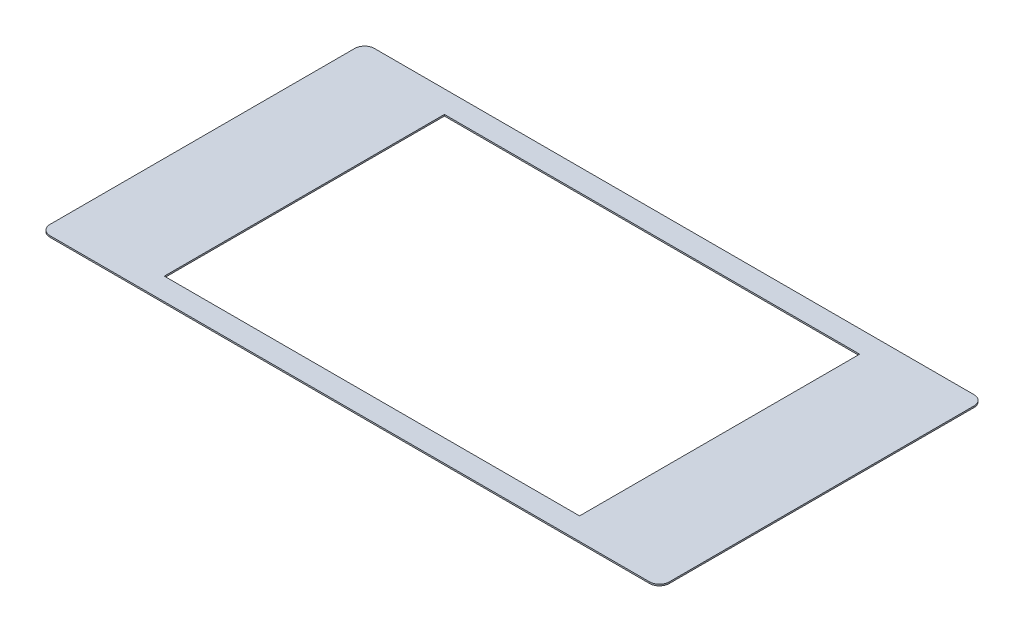
ISO-10303-21;
HEADER;
FILE_DESCRIPTION(('STEP AP214'),'2;1');
FILE_NAME('part.step','',(''),(''),'','','');
FILE_SCHEMA(('AUTOMOTIVE_DESIGN { 1 0 10303 214 1 1 1 1 }'));
ENDSEC;
DATA;
#1=APPLICATION_CONTEXT('core data for automotive mechanical design processes');
#2=APPLICATION_PROTOCOL_DEFINITION('international standard','automotive_design',2000,#1);
#3=PRODUCT_CONTEXT('',#1,'mechanical');
#4=PRODUCT('Part','Part','',(#3));
#5=PRODUCT_RELATED_PRODUCT_CATEGORY('part','',(#4));
#6=PRODUCT_DEFINITION_FORMATION('','',#4);
#7=PRODUCT_DEFINITION_CONTEXT('part definition',#1,'design');
#8=PRODUCT_DEFINITION('design','',#6,#7);
#9=PRODUCT_DEFINITION_SHAPE('','',#8);
#10=(LENGTH_UNIT() NAMED_UNIT(*) SI_UNIT(.MILLI.,.METRE.));
#11=(NAMED_UNIT(*) PLANE_ANGLE_UNIT() SI_UNIT($,.RADIAN.));
#12=(NAMED_UNIT(*) SI_UNIT($,.STERADIAN.) SOLID_ANGLE_UNIT());
#13=UNCERTAINTY_MEASURE_WITH_UNIT(LENGTH_MEASURE(1.E-05),#10,'distance_accuracy_value','');
#14=(GEOMETRIC_REPRESENTATION_CONTEXT(3) GLOBAL_UNCERTAINTY_ASSIGNED_CONTEXT((#13)) GLOBAL_UNIT_ASSIGNED_CONTEXT((#10,
#11,#12)) REPRESENTATION_CONTEXT('',''));
#15=CARTESIAN_POINT('',(0.,0.,0.));
#16=DIRECTION('',(0.,0.,1.));
#17=DIRECTION('',(1.,0.,0.));
#18=AXIS2_PLACEMENT_3D('',#15,#16,#17);
#19=CARTESIAN_POINT('',(2.41486728488105E-13,-34.8,0.));
#20=DIRECTION('',(0.,-1.,0.));
#21=DIRECTION('',(1.,0.,0.));
#22=AXIS2_PLACEMENT_3D('',#19,#20,#21);
#23=PLANE('',#22);
#24=DIRECTION('',(-1.,0.,0.));
#25=VECTOR('',#24,1.);
#26=CARTESIAN_POINT('',(-62.9999999999998,-34.8000000000004,33.));
#27=LINE('',#26,#25);
#28=CARTESIAN_POINT('',(61.0000000000002,-34.7999999999996,33.));
#29=VERTEX_POINT('',#28);
#30=CARTESIAN_POINT('',(-60.9999999999998,-34.8000000000004,33.));
#31=VERTEX_POINT('',#30);
#32=EDGE_CURVE('E169',#29,#31,#27,.T.);
#33=ORIENTED_EDGE('',*,*,#32,.T.);
#34=CARTESIAN_POINT('',(-60.9999999999998,-34.8000000000004,31.));
#35=DIRECTION('',(0.,-1.,0.));
#36=DIRECTION('',(1.,0.,0.));
#37=AXIS2_PLACEMENT_3D('',#34,#35,#36);
#38=CIRCLE('',#37,2.);
#39=CARTESIAN_POINT('',(-62.9999999999998,-34.8000000000004,31.));
#40=VERTEX_POINT('',#39);
#41=EDGE_CURVE('E209',#31,#40,#38,.T.);
#42=ORIENTED_EDGE('',*,*,#41,.T.);
#43=DIRECTION('',(0.,0.,-1.));
#44=VECTOR('',#43,1.);
#45=CARTESIAN_POINT('',(-62.9999999999998,-34.8000000000004,33.));
#46=LINE('',#45,#44);
#47=CARTESIAN_POINT('',(-62.9999999999998,-34.8000000000004,-31.));
#48=VERTEX_POINT('',#47);
#49=EDGE_CURVE('E173',#40,#48,#46,.T.);
#50=ORIENTED_EDGE('',*,*,#49,.T.);
#51=CARTESIAN_POINT('',(-60.9999999999998,-34.8000000000004,-31.));
#52=DIRECTION('',(0.,-1.,0.));
#53=DIRECTION('',(1.,0.,0.));
#54=AXIS2_PLACEMENT_3D('',#51,#52,#53);
#55=CIRCLE('',#54,2.);
#56=CARTESIAN_POINT('',(-60.9999999999998,-34.8000000000004,-33.));
#57=VERTEX_POINT('',#56);
#58=EDGE_CURVE('E55',#48,#57,#55,.T.);
#59=ORIENTED_EDGE('',*,*,#58,.T.);
#60=DIRECTION('',(1.,0.,0.));
#61=VECTOR('',#60,1.);
#62=CARTESIAN_POINT('',(-62.9999999999998,-34.8000000000004,-33.));
#63=LINE('',#62,#61);
#64=CARTESIAN_POINT('',(61.0000000000002,-34.7999999999996,-33.));
#65=VERTEX_POINT('',#64);
#66=EDGE_CURVE('E175',#57,#65,#63,.T.);
#67=ORIENTED_EDGE('',*,*,#66,.T.);
#68=CARTESIAN_POINT('',(61.0000000000002,-34.7999999999996,-31.));
#69=DIRECTION('',(0.,-1.,0.));
#70=DIRECTION('',(1.,0.,0.));
#71=AXIS2_PLACEMENT_3D('',#68,#69,#70);
#72=CIRCLE('',#71,2.);
#73=CARTESIAN_POINT('',(63.0000000000002,-34.7999999999996,-31.));
#74=VERTEX_POINT('',#73);
#75=EDGE_CURVE('E206',#65,#74,#72,.T.);
#76=ORIENTED_EDGE('',*,*,#75,.T.);
#77=DIRECTION('',(0.,0.,1.));
#78=VECTOR('',#77,1.);
#79=CARTESIAN_POINT('',(63.0000000000002,-34.7999999999996,33.));
#80=LINE('',#79,#78);
#81=CARTESIAN_POINT('',(63.0000000000002,-34.7999999999996,31.));
#82=VERTEX_POINT('',#81);
#83=EDGE_CURVE('E166',#74,#82,#80,.T.);
#84=ORIENTED_EDGE('',*,*,#83,.T.);
#85=CARTESIAN_POINT('',(61.0000000000002,-34.7999999999996,31.));
#86=DIRECTION('',(0.,-1.,0.));
#87=DIRECTION('',(1.,0.,0.));
#88=AXIS2_PLACEMENT_3D('',#85,#86,#87);
#89=CIRCLE('',#88,2.);
#90=EDGE_CURVE('E204',#82,#29,#89,.T.);
#91=ORIENTED_EDGE('',*,*,#90,.T.);
#92=EDGE_LOOP('',(#33,#42,#50,#59,#67,#76,#84,#91));
#93=FACE_BOUND('',#92,.T.);
#94=DIRECTION('',(-1.,0.,0.));
#95=VECTOR('',#94,1.);
#96=CARTESIAN_POINT('',(-42.2499999999995,-34.8000000000003,28.5));
#97=LINE('',#96,#95);
#98=CARTESIAN_POINT('',(42.25,-34.7999999999997,28.5));
#99=VERTEX_POINT('',#98);
#100=CARTESIAN_POINT('',(-42.2499999999995,-34.8000000000003,28.5));
#101=VERTEX_POINT('',#100);
#102=EDGE_CURVE('E135',#99,#101,#97,.T.);
#103=ORIENTED_EDGE('',*,*,#102,.F.);
#104=DIRECTION('',(0.,0.,1.));
#105=VECTOR('',#104,1.);
#106=CARTESIAN_POINT('',(42.25,-34.7999999999997,28.5));
#107=LINE('',#106,#105);
#108=CARTESIAN_POINT('',(42.25,-34.7999999999997,-28.5));
#109=VERTEX_POINT('',#108);
#110=EDGE_CURVE('E125',#109,#99,#107,.T.);
#111=ORIENTED_EDGE('',*,*,#110,.F.);
#112=DIRECTION('',(1.,0.,0.));
#113=VECTOR('',#112,1.);
#114=CARTESIAN_POINT('',(-42.2499999999995,-34.8000000000003,-28.5));
#115=LINE('',#114,#113);
#116=CARTESIAN_POINT('',(-42.2499999999995,-34.8000000000003,-28.5));
#117=VERTEX_POINT('',#116);
#118=EDGE_CURVE('E150',#117,#109,#115,.T.);
#119=ORIENTED_EDGE('',*,*,#118,.F.);
#120=DIRECTION('',(0.,0.,-1.));
#121=VECTOR('',#120,1.);
#122=CARTESIAN_POINT('',(-42.2499999999995,-34.8000000000003,28.5));
#123=LINE('',#122,#121);
#124=EDGE_CURVE('E148',#101,#117,#123,.T.);
#125=ORIENTED_EDGE('',*,*,#124,.F.);
#126=EDGE_LOOP('',(#103,#111,#119,#125));
#127=FACE_BOUND('',#126,.T.);
#128=ADVANCED_FACE('F33',(#93,#127),#23,.T.);
#129=CARTESIAN_POINT('',(2.39391839684799E-13,-34.5,0.));
#130=DIRECTION('',(0.,-1.,0.));
#131=DIRECTION('',(1.,0.,0.));
#132=AXIS2_PLACEMENT_3D('',#129,#130,#131);
#133=PLANE('',#132);
#134=DIRECTION('',(0.,0.,-1.));
#135=VECTOR('',#134,1.);
#136=CARTESIAN_POINT('',(-62.9999999999998,-34.5000000000004,33.));
#137=LINE('',#136,#135);
#138=CARTESIAN_POINT('',(-62.9999999999998,-34.5000000000004,31.));
#139=VERTEX_POINT('',#138);
#140=CARTESIAN_POINT('',(-62.9999999999998,-34.5000000000004,-31.));
#141=VERTEX_POINT('',#140);
#142=EDGE_CURVE('E183',#139,#141,#137,.T.);
#143=ORIENTED_EDGE('',*,*,#142,.F.);
#144=CARTESIAN_POINT('',(-60.9999999999998,-34.5000000000004,31.));
#145=DIRECTION('',(0.,-1.,0.));
#146=DIRECTION('',(1.,0.,0.));
#147=AXIS2_PLACEMENT_3D('',#144,#145,#146);
#148=CIRCLE('',#147,2.);
#149=CARTESIAN_POINT('',(-60.9999999999998,-34.5000000000004,33.));
#150=VERTEX_POINT('',#149);
#151=EDGE_CURVE('E197',#139,#150,#148,.F.);
#152=ORIENTED_EDGE('',*,*,#151,.T.);
#153=DIRECTION('',(-1.,0.,0.));
#154=VECTOR('',#153,1.);
#155=CARTESIAN_POINT('',(-62.9999999999998,-34.5000000000004,33.));
#156=LINE('',#155,#154);
#157=CARTESIAN_POINT('',(61.0000000000002,-34.4999999999996,33.));
#158=VERTEX_POINT('',#157);
#159=EDGE_CURVE('E180',#158,#150,#156,.T.);
#160=ORIENTED_EDGE('',*,*,#159,.F.);
#161=CARTESIAN_POINT('',(61.0000000000002,-34.4999999999996,31.));
#162=DIRECTION('',(0.,-1.,0.));
#163=DIRECTION('',(1.,0.,0.));
#164=AXIS2_PLACEMENT_3D('',#161,#162,#163);
#165=CIRCLE('',#164,2.);
#166=CARTESIAN_POINT('',(63.0000000000002,-34.4999999999996,31.));
#167=VERTEX_POINT('',#166);
#168=EDGE_CURVE('E191',#158,#167,#165,.F.);
#169=ORIENTED_EDGE('',*,*,#168,.T.);
#170=DIRECTION('',(0.,0.,1.));
#171=VECTOR('',#170,1.);
#172=CARTESIAN_POINT('',(63.0000000000002,-34.4999999999996,33.));
#173=LINE('',#172,#171);
#174=CARTESIAN_POINT('',(63.0000000000002,-34.4999999999996,-31.));
#175=VERTEX_POINT('',#174);
#176=EDGE_CURVE('E143',#175,#167,#173,.T.);
#177=ORIENTED_EDGE('',*,*,#176,.F.);
#178=CARTESIAN_POINT('',(61.0000000000002,-34.4999999999996,-31.));
#179=DIRECTION('',(0.,-1.,0.));
#180=DIRECTION('',(1.,0.,0.));
#181=AXIS2_PLACEMENT_3D('',#178,#179,#180);
#182=CIRCLE('',#181,2.);
#183=CARTESIAN_POINT('',(61.0000000000002,-34.4999999999996,-33.));
#184=VERTEX_POINT('',#183);
#185=EDGE_CURVE('E193',#175,#184,#182,.F.);
#186=ORIENTED_EDGE('',*,*,#185,.T.);
#187=DIRECTION('',(1.,0.,0.));
#188=VECTOR('',#187,1.);
#189=CARTESIAN_POINT('',(-62.9999999999998,-34.5000000000004,-33.));
#190=LINE('',#189,#188);
#191=CARTESIAN_POINT('',(-60.9999999999998,-34.5000000000004,-33.));
#192=VERTEX_POINT('',#191);
#193=EDGE_CURVE('E170',#192,#184,#190,.T.);
#194=ORIENTED_EDGE('',*,*,#193,.F.);
#195=CARTESIAN_POINT('',(-60.9999999999998,-34.5000000000004,-31.));
#196=DIRECTION('',(0.,-1.,0.));
#197=DIRECTION('',(1.,0.,0.));
#198=AXIS2_PLACEMENT_3D('',#195,#196,#197);
#199=CIRCLE('',#198,2.);
#200=EDGE_CURVE('E195',#192,#141,#199,.F.);
#201=ORIENTED_EDGE('',*,*,#200,.T.);
#202=EDGE_LOOP('',(#143,#152,#160,#169,#177,#186,#194,#201));
#203=FACE_BOUND('',#202,.T.);
#204=DIRECTION('',(0.,0.,1.));
#205=VECTOR('',#204,1.);
#206=CARTESIAN_POINT('',(42.25,-34.4999999999997,28.5));
#207=LINE('',#206,#205);
#208=CARTESIAN_POINT('',(42.25,-34.4999999999997,-28.5));
#209=VERTEX_POINT('',#208);
#210=CARTESIAN_POINT('',(42.25,-34.4999999999997,28.5));
#211=VERTEX_POINT('',#210);
#212=EDGE_CURVE('E154',#209,#211,#207,.T.);
#213=ORIENTED_EDGE('',*,*,#212,.T.);
#214=DIRECTION('',(-1.,0.,0.));
#215=VECTOR('',#214,1.);
#216=CARTESIAN_POINT('',(-42.2499999999995,-34.5000000000003,28.5));
#217=LINE('',#216,#215);
#218=CARTESIAN_POINT('',(-42.2499999999995,-34.5000000000003,28.5));
#219=VERTEX_POINT('',#218);
#220=EDGE_CURVE('E142',#211,#219,#217,.T.);
#221=ORIENTED_EDGE('',*,*,#220,.T.);
#222=DIRECTION('',(0.,0.,-1.));
#223=VECTOR('',#222,1.);
#224=CARTESIAN_POINT('',(-42.2499999999995,-34.5000000000003,28.5));
#225=LINE('',#224,#223);
#226=CARTESIAN_POINT('',(-42.2499999999995,-34.5000000000003,-28.5));
#227=VERTEX_POINT('',#226);
#228=EDGE_CURVE('E157',#219,#227,#225,.T.);
#229=ORIENTED_EDGE('',*,*,#228,.T.);
#230=DIRECTION('',(1.,0.,0.));
#231=VECTOR('',#230,1.);
#232=CARTESIAN_POINT('',(-42.2499999999995,-34.5000000000003,-28.5));
#233=LINE('',#232,#231);
#234=EDGE_CURVE('E136',#227,#209,#233,.T.);
#235=ORIENTED_EDGE('',*,*,#234,.T.);
#236=EDGE_LOOP('',(#213,#221,#229,#235));
#237=FACE_BOUND('',#236,.T.);
#238=ADVANCED_FACE('F231',(#203,#237),#133,.F.);
#239=CARTESIAN_POINT('',(63.0000000000002,-34.7999999999996,33.));
#240=DIRECTION('',(-1.,0.,0.));
#241=DIRECTION('',(0.,-1.,0.));
#242=AXIS2_PLACEMENT_3D('',#239,#240,#241);
#243=PLANE('',#242);
#244=ORIENTED_EDGE('',*,*,#83,.F.);
#245=DIRECTION('',(0.,1.,0.));
#246=VECTOR('',#245,1.);
#247=CARTESIAN_POINT('',(63.0000000000002,-34.7999999999996,-31.));
#248=LINE('',#247,#246);
#249=EDGE_CURVE('E11',#74,#175,#248,.T.);
#250=ORIENTED_EDGE('',*,*,#249,.T.);
#251=ORIENTED_EDGE('',*,*,#176,.T.);
#252=DIRECTION('',(0.,1.,0.));
#253=VECTOR('',#252,1.);
#254=CARTESIAN_POINT('',(63.0000000000002,-34.7999999999996,31.));
#255=LINE('',#254,#253);
#256=EDGE_CURVE('E41',#167,#82,#255,.F.);
#257=ORIENTED_EDGE('',*,*,#256,.T.);
#258=EDGE_LOOP('',(#244,#250,#251,#257));
#259=FACE_BOUND('',#258,.T.);
#260=ADVANCED_FACE('F217',(#259),#243,.F.);
#261=CARTESIAN_POINT('',(-62.9999999999998,-34.8000000000004,33.));
#262=DIRECTION('',(0.,0.,-1.));
#263=DIRECTION('',(-1.,0.,0.));
#264=AXIS2_PLACEMENT_3D('',#261,#262,#263);
#265=PLANE('',#264);
#266=ORIENTED_EDGE('',*,*,#159,.T.);
#267=DIRECTION('',(0.,1.,0.));
#268=VECTOR('',#267,1.);
#269=CARTESIAN_POINT('',(-60.9999999999998,-34.8000000000004,33.));
#270=LINE('',#269,#268);
#271=EDGE_CURVE('E202',#150,#31,#270,.F.);
#272=ORIENTED_EDGE('',*,*,#271,.T.);
#273=ORIENTED_EDGE('',*,*,#32,.F.);
#274=DIRECTION('',(0.,1.,0.));
#275=VECTOR('',#274,1.);
#276=CARTESIAN_POINT('',(61.0000000000002,-34.7999999999996,33.));
#277=LINE('',#276,#275);
#278=EDGE_CURVE('E199',#29,#158,#277,.T.);
#279=ORIENTED_EDGE('',*,*,#278,.T.);
#280=EDGE_LOOP('',(#266,#272,#273,#279));
#281=FACE_BOUND('',#280,.T.);
#282=ADVANCED_FACE('F227',(#281),#265,.F.);
#283=CARTESIAN_POINT('',(-62.9999999999998,-34.8000000000004,33.));
#284=DIRECTION('',(1.,0.,0.));
#285=DIRECTION('',(0.,1.,0.));
#286=AXIS2_PLACEMENT_3D('',#283,#284,#285);
#287=PLANE('',#286);
#288=ORIENTED_EDGE('',*,*,#49,.F.);
#289=DIRECTION('',(0.,1.,0.));
#290=VECTOR('',#289,1.);
#291=CARTESIAN_POINT('',(-62.9999999999998,-34.8000000000004,31.));
#292=LINE('',#291,#290);
#293=EDGE_CURVE('E188',#40,#139,#292,.T.);
#294=ORIENTED_EDGE('',*,*,#293,.T.);
#295=ORIENTED_EDGE('',*,*,#142,.T.);
#296=DIRECTION('',(0.,1.,0.));
#297=VECTOR('',#296,1.);
#298=CARTESIAN_POINT('',(-62.9999999999998,-34.8000000000004,-31.));
#299=LINE('',#298,#297);
#300=EDGE_CURVE('E177',#141,#48,#299,.F.);
#301=ORIENTED_EDGE('',*,*,#300,.T.);
#302=EDGE_LOOP('',(#288,#294,#295,#301));
#303=FACE_BOUND('',#302,.T.);
#304=ADVANCED_FACE('F239',(#303),#287,.F.);
#305=CARTESIAN_POINT('',(-62.9999999999998,-34.8000000000004,-33.));
#306=DIRECTION('',(0.,0.,1.));
#307=DIRECTION('',(1.,0.,0.));
#308=AXIS2_PLACEMENT_3D('',#305,#306,#307);
#309=PLANE('',#308);
#310=ORIENTED_EDGE('',*,*,#66,.F.);
#311=DIRECTION('',(0.,1.,0.));
#312=VECTOR('',#311,1.);
#313=CARTESIAN_POINT('',(-60.9999999999998,-34.8000000000004,-33.));
#314=LINE('',#313,#312);
#315=EDGE_CURVE('E212',#57,#192,#314,.T.);
#316=ORIENTED_EDGE('',*,*,#315,.T.);
#317=ORIENTED_EDGE('',*,*,#193,.T.);
#318=DIRECTION('',(0.,1.,0.));
#319=VECTOR('',#318,1.);
#320=CARTESIAN_POINT('',(61.0000000000002,-34.7999999999996,-33.));
#321=LINE('',#320,#319);
#322=EDGE_CURVE('E48',#184,#65,#321,.F.);
#323=ORIENTED_EDGE('',*,*,#322,.T.);
#324=EDGE_LOOP('',(#310,#316,#317,#323));
#325=FACE_BOUND('',#324,.T.);
#326=ADVANCED_FACE('F245',(#325),#309,.F.);
#327=CARTESIAN_POINT('',(42.25,-34.7999999999997,28.5));
#328=DIRECTION('',(-1.,0.,0.));
#329=DIRECTION('',(0.,-1.,0.));
#330=AXIS2_PLACEMENT_3D('',#327,#328,#329);
#331=PLANE('',#330);
#332=ORIENTED_EDGE('',*,*,#212,.F.);
#333=DIRECTION('',(0.,1.,0.));
#334=VECTOR('',#333,1.);
#335=CARTESIAN_POINT('',(42.25,-34.7999999999997,-28.5));
#336=LINE('',#335,#334);
#337=EDGE_CURVE('E131',#109,#209,#336,.T.);
#338=ORIENTED_EDGE('',*,*,#337,.F.);
#339=ORIENTED_EDGE('',*,*,#110,.T.);
#340=DIRECTION('',(0.,1.,0.));
#341=VECTOR('',#340,1.);
#342=CARTESIAN_POINT('',(42.25,-34.7999999999997,28.5));
#343=LINE('',#342,#341);
#344=EDGE_CURVE('E128',#99,#211,#343,.T.);
#345=ORIENTED_EDGE('',*,*,#344,.T.);
#346=EDGE_LOOP('',(#332,#338,#339,#345));
#347=FACE_BOUND('',#346,.T.);
#348=ADVANCED_FACE('F127',(#347),#331,.T.);
#349=CARTESIAN_POINT('',(-42.2499999999995,-34.8000000000003,28.5));
#350=DIRECTION('',(0.,0.,-1.));
#351=DIRECTION('',(-1.,0.,0.));
#352=AXIS2_PLACEMENT_3D('',#349,#350,#351);
#353=PLANE('',#352);
#354=ORIENTED_EDGE('',*,*,#220,.F.);
#355=ORIENTED_EDGE('',*,*,#344,.F.);
#356=ORIENTED_EDGE('',*,*,#102,.T.);
#357=DIRECTION('',(0.,1.,0.));
#358=VECTOR('',#357,1.);
#359=CARTESIAN_POINT('',(-42.2499999999995,-34.8000000000003,28.5));
#360=LINE('',#359,#358);
#361=EDGE_CURVE('E144',#101,#219,#360,.T.);
#362=ORIENTED_EDGE('',*,*,#361,.T.);
#363=EDGE_LOOP('',(#354,#355,#356,#362));
#364=FACE_BOUND('',#363,.T.);
#365=ADVANCED_FACE('F139',(#364),#353,.T.);
#366=CARTESIAN_POINT('',(-42.2499999999995,-34.8000000000003,28.5));
#367=DIRECTION('',(1.,0.,0.));
#368=DIRECTION('',(0.,1.,0.));
#369=AXIS2_PLACEMENT_3D('',#366,#367,#368);
#370=PLANE('',#369);
#371=ORIENTED_EDGE('',*,*,#228,.F.);
#372=ORIENTED_EDGE('',*,*,#361,.F.);
#373=ORIENTED_EDGE('',*,*,#124,.T.);
#374=DIRECTION('',(0.,1.,0.));
#375=VECTOR('',#374,1.);
#376=CARTESIAN_POINT('',(-42.2499999999995,-34.8000000000003,-28.5));
#377=LINE('',#376,#375);
#378=EDGE_CURVE('E163',#117,#227,#377,.T.);
#379=ORIENTED_EDGE('',*,*,#378,.T.);
#380=EDGE_LOOP('',(#371,#372,#373,#379));
#381=FACE_BOUND('',#380,.T.);
#382=ADVANCED_FACE('F276',(#381),#370,.T.);
#383=CARTESIAN_POINT('',(-42.2499999999995,-34.8000000000003,-28.5));
#384=DIRECTION('',(0.,0.,1.));
#385=DIRECTION('',(1.,0.,0.));
#386=AXIS2_PLACEMENT_3D('',#383,#384,#385);
#387=PLANE('',#386);
#388=ORIENTED_EDGE('',*,*,#234,.F.);
#389=ORIENTED_EDGE('',*,*,#378,.F.);
#390=ORIENTED_EDGE('',*,*,#118,.T.);
#391=ORIENTED_EDGE('',*,*,#337,.T.);
#392=EDGE_LOOP('',(#388,#389,#390,#391));
#393=FACE_BOUND('',#392,.T.);
#394=ADVANCED_FACE('F272',(#393),#387,.T.);
#395=CARTESIAN_POINT('',(-60.9999999999998,-34.8000000000004,31.));
#396=DIRECTION('',(0.,1.,0.));
#397=DIRECTION('',(-1.,0.,0.));
#398=AXIS2_PLACEMENT_3D('',#395,#396,#397);
#399=CYLINDRICAL_SURFACE('',#398,2.);
#400=ORIENTED_EDGE('',*,*,#41,.F.);
#401=ORIENTED_EDGE('',*,*,#271,.F.);
#402=ORIENTED_EDGE('',*,*,#151,.F.);
#403=ORIENTED_EDGE('',*,*,#293,.F.);
#404=EDGE_LOOP('',(#400,#401,#402,#403));
#405=FACE_BOUND('',#404,.T.);
#406=ADVANCED_FACE('F236',(#405),#399,.T.);
#407=CARTESIAN_POINT('',(-60.9999999999998,-34.8000000000004,-31.));
#408=DIRECTION('',(0.,1.,0.));
#409=DIRECTION('',(-1.,0.,0.));
#410=AXIS2_PLACEMENT_3D('',#407,#408,#409);
#411=CYLINDRICAL_SURFACE('',#410,2.);
#412=ORIENTED_EDGE('',*,*,#58,.F.);
#413=ORIENTED_EDGE('',*,*,#300,.F.);
#414=ORIENTED_EDGE('',*,*,#200,.F.);
#415=ORIENTED_EDGE('',*,*,#315,.F.);
#416=EDGE_LOOP('',(#412,#413,#414,#415));
#417=FACE_BOUND('',#416,.T.);
#418=ADVANCED_FACE('F243',(#417),#411,.T.);
#419=CARTESIAN_POINT('',(61.0000000000002,-34.7999999999996,-31.));
#420=DIRECTION('',(0.,1.,0.));
#421=DIRECTION('',(-1.,0.,0.));
#422=AXIS2_PLACEMENT_3D('',#419,#420,#421);
#423=CYLINDRICAL_SURFACE('',#422,2.);
#424=ORIENTED_EDGE('',*,*,#75,.F.);
#425=ORIENTED_EDGE('',*,*,#322,.F.);
#426=ORIENTED_EDGE('',*,*,#185,.F.);
#427=ORIENTED_EDGE('',*,*,#249,.F.);
#428=EDGE_LOOP('',(#424,#425,#426,#427));
#429=FACE_BOUND('',#428,.T.);
#430=ADVANCED_FACE('F247',(#429),#423,.T.);
#431=CARTESIAN_POINT('',(61.0000000000002,-34.7999999999996,31.));
#432=DIRECTION('',(0.,1.,0.));
#433=DIRECTION('',(-1.,0.,0.));
#434=AXIS2_PLACEMENT_3D('',#431,#432,#433);
#435=CYLINDRICAL_SURFACE('',#434,2.);
#436=ORIENTED_EDGE('',*,*,#90,.F.);
#437=ORIENTED_EDGE('',*,*,#256,.F.);
#438=ORIENTED_EDGE('',*,*,#168,.F.);
#439=ORIENTED_EDGE('',*,*,#278,.F.);
#440=EDGE_LOOP('',(#436,#437,#438,#439));
#441=FACE_BOUND('',#440,.T.);
#442=ADVANCED_FACE('F35',(#441),#435,.T.);
#443=CLOSED_SHELL('',(#128,#238,#260,#282,#304,#326,#348,#365,#382,#394,#406,#418,#430,#442));
#444=MANIFOLD_SOLID_BREP('B2',#443);
#445=ADVANCED_BREP_SHAPE_REPRESENTATION('',(#18,#444),#14);
#446=SHAPE_DEFINITION_REPRESENTATION(#9,#445);
ENDSEC;
END-ISO-10303-21;
